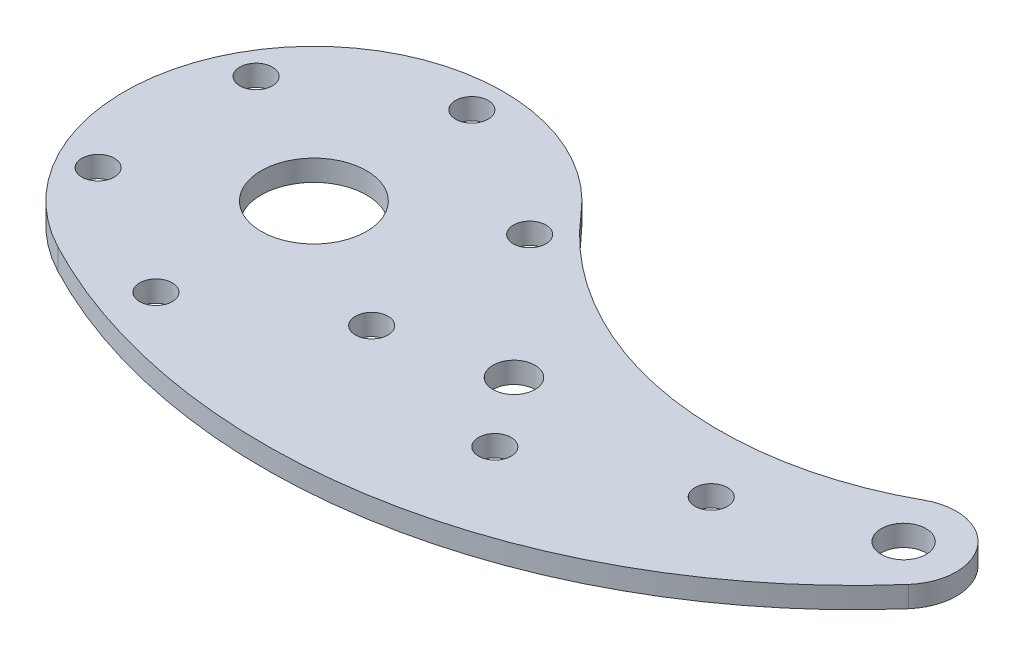
ISO-10303-21;
HEADER;
FILE_DESCRIPTION(('STEP AP214'),'2;1');
FILE_NAME('part.step','',(''),(''),'','','');
FILE_SCHEMA(('AUTOMOTIVE_DESIGN { 1 0 10303 214 1 1 1 1 }'));
ENDSEC;
DATA;
#1=APPLICATION_CONTEXT('core data for automotive mechanical design processes');
#2=APPLICATION_PROTOCOL_DEFINITION('international standard','automotive_design',2000,#1);
#3=PRODUCT_CONTEXT('',#1,'mechanical');
#4=PRODUCT('Part','Part','',(#3));
#5=PRODUCT_RELATED_PRODUCT_CATEGORY('part','',(#4));
#6=PRODUCT_DEFINITION_FORMATION('','',#4);
#7=PRODUCT_DEFINITION_CONTEXT('part definition',#1,'design');
#8=PRODUCT_DEFINITION('design','',#6,#7);
#9=PRODUCT_DEFINITION_SHAPE('','',#8);
#10=(LENGTH_UNIT() NAMED_UNIT(*) SI_UNIT(.MILLI.,.METRE.));
#11=(NAMED_UNIT(*) PLANE_ANGLE_UNIT() SI_UNIT($,.RADIAN.));
#12=(NAMED_UNIT(*) SI_UNIT($,.STERADIAN.) SOLID_ANGLE_UNIT());
#13=UNCERTAINTY_MEASURE_WITH_UNIT(LENGTH_MEASURE(1.E-05),#10,'distance_accuracy_value','');
#14=(GEOMETRIC_REPRESENTATION_CONTEXT(3) GLOBAL_UNCERTAINTY_ASSIGNED_CONTEXT((#13)) GLOBAL_UNIT_ASSIGNED_CONTEXT((#10,
#11,#12)) REPRESENTATION_CONTEXT('',''));
#15=CARTESIAN_POINT('',(0.,0.,0.));
#16=DIRECTION('',(0.,0.,1.));
#17=DIRECTION('',(1.,0.,0.));
#18=AXIS2_PLACEMENT_3D('',#15,#16,#17);
#19=CARTESIAN_POINT('',(0.,3.175,0.));
#20=DIRECTION('',(0.,-1.,0.));
#21=DIRECTION('',(0.,0.,-1.));
#22=AXIS2_PLACEMENT_3D('',#19,#20,#21);
#23=CYLINDRICAL_SURFACE('',#22,28.575);
#24=CARTESIAN_POINT('',(0.,0.,0.));
#25=DIRECTION('',(0.,1.,0.));
#26=DIRECTION('',(0.,0.,1.));
#27=AXIS2_PLACEMENT_3D('',#24,#25,#26);
#28=CIRCLE('',#27,28.575);
#29=CARTESIAN_POINT('',(21.7731294642857,0.,-18.5057142075483));
#30=VERTEX_POINT('',#29);
#31=CARTESIAN_POINT('',(-13.2871064379699,0.,25.2978937365556));
#32=VERTEX_POINT('',#31);
#33=EDGE_CURVE('E122',#30,#32,#28,.T.);
#34=ORIENTED_EDGE('',*,*,#33,.T.);
#35=DIRECTION('',(0.,-1.,0.));
#36=VECTOR('',#35,1.);
#37=CARTESIAN_POINT('',(-13.2871064379699,3.175,25.2978937365556));
#38=LINE('',#37,#36);
#39=CARTESIAN_POINT('',(-13.2871064379699,3.175,25.2978937365556));
#40=VERTEX_POINT('',#39);
#41=EDGE_CURVE('E11',#40,#32,#38,.T.);
#42=ORIENTED_EDGE('',*,*,#41,.F.);
#43=CARTESIAN_POINT('',(0.,3.175,0.));
#44=DIRECTION('',(0.,1.,0.));
#45=DIRECTION('',(0.,0.,1.));
#46=AXIS2_PLACEMENT_3D('',#43,#44,#45);
#47=CIRCLE('',#46,28.575);
#48=CARTESIAN_POINT('',(21.7731294642857,3.175,-18.5057142075483));
#49=VERTEX_POINT('',#48);
#50=EDGE_CURVE('E100',#49,#40,#47,.T.);
#51=ORIENTED_EDGE('',*,*,#50,.F.);
#52=DIRECTION('',(0.,-1.,0.));
#53=VECTOR('',#52,1.);
#54=CARTESIAN_POINT('',(21.7731294642857,3.175,-18.5057142075483));
#55=LINE('',#54,#53);
#56=EDGE_CURVE('E67',#49,#30,#55,.T.);
#57=ORIENTED_EDGE('',*,*,#56,.T.);
#58=EDGE_LOOP('',(#34,#42,#51,#57));
#59=FACE_BOUND('',#58,.T.);
#60=ADVANCED_FACE('F49',(#59),#23,.T.);
#61=CARTESIAN_POINT('',(28.0505580357143,3.175,-53.4066645549507));
#62=DIRECTION('',(0.,-1.,0.));
#63=DIRECTION('',(0.,0.,-1.));
#64=AXIS2_PLACEMENT_3D('',#61,#62,#63);
#65=CYLINDRICAL_SURFACE('',#64,88.9);
#66=CARTESIAN_POINT('',(28.0505580357143,0.,-53.4066645549507));
#67=DIRECTION('',(0.,1.,0.));
#68=DIRECTION('',(0.,0.,1.));
#69=AXIS2_PLACEMENT_3D('',#66,#67,#68);
#70=CIRCLE('',#69,88.9);
#71=CARTESIAN_POINT('',(94.8656315651261,0.,5.23594750538732));
#72=VERTEX_POINT('',#71);
#73=EDGE_CURVE('E105',#32,#72,#70,.T.);
#74=ORIENTED_EDGE('',*,*,#73,.T.);
#75=DIRECTION('',(0.,-1.,0.));
#76=VECTOR('',#75,1.);
#77=CARTESIAN_POINT('',(94.8656315651261,3.175,5.23594750538732));
#78=LINE('',#77,#76);
#79=CARTESIAN_POINT('',(94.8656315651261,3.175,5.23594750538732));
#80=VERTEX_POINT('',#79);
#81=EDGE_CURVE('E59',#80,#72,#78,.T.);
#82=ORIENTED_EDGE('',*,*,#81,.F.);
#83=CARTESIAN_POINT('',(28.0505580357143,3.175,-53.4066645549507));
#84=DIRECTION('',(0.,1.,0.));
#85=DIRECTION('',(0.,0.,1.));
#86=AXIS2_PLACEMENT_3D('',#83,#84,#85);
#87=CIRCLE('',#86,88.9);
#88=EDGE_CURVE('E93',#40,#80,#87,.T.);
#89=ORIENTED_EDGE('',*,*,#88,.F.);
#90=ORIENTED_EDGE('',*,*,#41,.T.);
#91=EDGE_LOOP('',(#74,#82,#89,#90));
#92=FACE_BOUND('',#91,.T.);
#93=ADVANCED_FACE('F104',(#92),#65,.T.);
#94=CARTESIAN_POINT('',(88.9,3.175,0.));
#95=DIRECTION('',(0.,-1.,0.));
#96=DIRECTION('',(0.,0.,-1.));
#97=AXIS2_PLACEMENT_3D('',#94,#95,#96);
#98=CYLINDRICAL_SURFACE('',#97,7.9375);
#99=CARTESIAN_POINT('',(88.9,0.,0.));
#100=DIRECTION('',(0.,1.,0.));
#101=DIRECTION('',(0.,0.,1.));
#102=AXIS2_PLACEMENT_3D('',#99,#100,#101);
#103=CIRCLE('',#102,7.9375);
#104=CARTESIAN_POINT('',(85.0595831322394,0.,-6.94658941724785));
#105=VERTEX_POINT('',#104);
#106=EDGE_CURVE('E125',#72,#105,#103,.T.);
#107=ORIENTED_EDGE('',*,*,#106,.T.);
#108=DIRECTION('',(0.,-1.,0.));
#109=VECTOR('',#108,1.);
#110=CARTESIAN_POINT('',(85.0595831322394,3.175,-6.94658941724785));
#111=LINE('',#110,#109);
#112=CARTESIAN_POINT('',(85.0595831322394,3.175,-6.94658941724785));
#113=VERTEX_POINT('',#112);
#114=EDGE_CURVE('E82',#113,#105,#111,.T.);
#115=ORIENTED_EDGE('',*,*,#114,.F.);
#116=CARTESIAN_POINT('',(88.9,3.175,0.));
#117=DIRECTION('',(0.,1.,0.));
#118=DIRECTION('',(0.,0.,1.));
#119=AXIS2_PLACEMENT_3D('',#116,#117,#118);
#120=CIRCLE('',#119,7.9375);
#121=EDGE_CURVE('E99',#80,#113,#120,.T.);
#122=ORIENTED_EDGE('',*,*,#121,.F.);
#123=ORIENTED_EDGE('',*,*,#81,.T.);
#124=EDGE_LOOP('',(#107,#115,#122,#123));
#125=FACE_BOUND('',#124,.T.);
#126=ADVANCED_FACE('F109',(#125),#98,.T.);
#127=CARTESIAN_POINT('',(88.9,3.175,0.));
#128=DIRECTION('',(0.,-1.,0.));
#129=DIRECTION('',(0.,0.,-1.));
#130=AXIS2_PLACEMENT_3D('',#127,#128,#129);
#131=CYLINDRICAL_SURFACE('',#130,3.37819999999999);
#132=CARTESIAN_POINT('',(88.9,3.175,0.));
#133=DIRECTION('',(0.,1.,0.));
#134=DIRECTION('',(0.,0.,1.));
#135=AXIS2_PLACEMENT_3D('',#132,#133,#134);
#136=CIRCLE('',#135,3.37819999999999);
#137=CARTESIAN_POINT('',(88.9,3.175,3.37819999999999));
#138=VERTEX_POINT('',#137);
#139=EDGE_CURVE('E134',#138,#138,#136,.T.);
#140=ORIENTED_EDGE('',*,*,#139,.T.);
#141=EDGE_LOOP('',(#140));
#142=FACE_BOUND('',#141,.T.);
#143=CARTESIAN_POINT('',(88.9,0.,0.));
#144=DIRECTION('',(0.,1.,0.));
#145=DIRECTION('',(0.,0.,1.));
#146=AXIS2_PLACEMENT_3D('',#143,#144,#145);
#147=CIRCLE('',#146,3.37819999999999);
#148=CARTESIAN_POINT('',(88.9,0.,3.37819999999999));
#149=VERTEX_POINT('',#148);
#150=EDGE_CURVE('E118',#149,#149,#147,.T.);
#151=ORIENTED_EDGE('',*,*,#150,.F.);
#152=EDGE_LOOP('',(#151));
#153=FACE_BOUND('',#152,.T.);
#154=ADVANCED_FACE('F219',(#142,#153),#131,.F.);
#155=CARTESIAN_POINT('',(0.,3.175,0.));
#156=DIRECTION('',(0.,-1.,0.));
#157=DIRECTION('',(0.,0.,-1.));
#158=AXIS2_PLACEMENT_3D('',#155,#156,#157);
#159=CYLINDRICAL_SURFACE('',#158,7.9375);
#160=CARTESIAN_POINT('',(0.,3.175,0.));
#161=DIRECTION('',(0.,1.,0.));
#162=DIRECTION('',(0.,0.,1.));
#163=AXIS2_PLACEMENT_3D('',#160,#161,#162);
#164=CIRCLE('',#163,7.9375);
#165=CARTESIAN_POINT('',(0.,3.175,7.9375));
#166=VERTEX_POINT('',#165);
#167=EDGE_CURVE('E130',#166,#166,#164,.T.);
#168=ORIENTED_EDGE('',*,*,#167,.T.);
#169=EDGE_LOOP('',(#168));
#170=FACE_BOUND('',#169,.T.);
#171=CARTESIAN_POINT('',(0.,0.,0.));
#172=DIRECTION('',(0.,1.,0.));
#173=DIRECTION('',(0.,0.,1.));
#174=AXIS2_PLACEMENT_3D('',#171,#172,#173);
#175=CIRCLE('',#174,7.9375);
#176=CARTESIAN_POINT('',(0.,0.,7.9375));
#177=VERTEX_POINT('',#176);
#178=EDGE_CURVE('E115',#177,#177,#175,.T.);
#179=ORIENTED_EDGE('',*,*,#178,.F.);
#180=EDGE_LOOP('',(#179));
#181=FACE_BOUND('',#180,.T.);
#182=ADVANCED_FACE('F51',(#170,#181),#159,.F.);
#183=CARTESIAN_POINT('',(60.4809151785714,3.175,-51.404761687634));
#184=DIRECTION('',(0.,-1.,0.));
#185=DIRECTION('',(0.,0.,-1.));
#186=AXIS2_PLACEMENT_3D('',#183,#184,#185);
#187=CYLINDRICAL_SURFACE('',#186,50.8);
#188=CARTESIAN_POINT('',(60.4809151785714,0.,-51.404761687634));
#189=DIRECTION('',(0.,1.,0.));
#190=DIRECTION('',(0.,0.,1.));
#191=AXIS2_PLACEMENT_3D('',#188,#189,#190);
#192=CIRCLE('',#191,50.8);
#193=EDGE_CURVE('E127',#30,#105,#192,.T.);
#194=ORIENTED_EDGE('',*,*,#193,.F.);
#195=ORIENTED_EDGE('',*,*,#56,.F.);
#196=CARTESIAN_POINT('',(60.4809151785714,3.175,-51.404761687634));
#197=DIRECTION('',(0.,1.,0.));
#198=DIRECTION('',(0.,0.,1.));
#199=AXIS2_PLACEMENT_3D('',#196,#197,#198);
#200=CIRCLE('',#199,50.8);
#201=EDGE_CURVE('E110',#49,#113,#200,.T.);
#202=ORIENTED_EDGE('',*,*,#201,.T.);
#203=ORIENTED_EDGE('',*,*,#114,.T.);
#204=EDGE_LOOP('',(#194,#195,#202,#203));
#205=FACE_BOUND('',#204,.T.);
#206=ADVANCED_FACE('F198',(#205),#187,.F.);
#207=CARTESIAN_POINT('',(0.,3.175,0.));
#208=DIRECTION('',(0.,1.,0.));
#209=DIRECTION('',(0.,0.,1.));
#210=AXIS2_PLACEMENT_3D('',#207,#208,#209);
#211=PLANE('',#210);
#212=CARTESIAN_POINT('',(68.58,3.175,8.68011214699575));
#213=DIRECTION('',(0.,1.,0.));
#214=DIRECTION('',(0.,0.,1.));
#215=AXIS2_PLACEMENT_3D('',#212,#213,#214);
#216=CIRCLE('',#215,2.45745);
#217=CARTESIAN_POINT('',(68.58,3.175,11.1375621469957));
#218=VERTEX_POINT('',#217);
#219=EDGE_CURVE('E188',#218,#218,#216,.T.);
#220=ORIENTED_EDGE('',*,*,#219,.F.);
#221=EDGE_LOOP('',(#220));
#222=FACE_BOUND('',#221,.T.);
#223=CARTESIAN_POINT('',(45.72,3.175,18.445238312366));
#224=DIRECTION('',(0.,1.,0.));
#225=DIRECTION('',(0.,0.,1.));
#226=AXIS2_PLACEMENT_3D('',#223,#224,#225);
#227=CIRCLE('',#226,2.45745);
#228=CARTESIAN_POINT('',(45.72,3.175,20.902688312366));
#229=VERTEX_POINT('',#228);
#230=EDGE_CURVE('E182',#229,#229,#227,.T.);
#231=ORIENTED_EDGE('',*,*,#230,.F.);
#232=EDGE_LOOP('',(#231));
#233=FACE_BOUND('',#232,.T.);
#234=CARTESIAN_POINT('',(38.1,3.175,7.9375));
#235=DIRECTION('',(0.,1.,0.));
#236=DIRECTION('',(0.,0.,1.));
#237=AXIS2_PLACEMENT_3D('',#234,#235,#236);
#238=CIRCLE('',#237,3.17499999999998);
#239=CARTESIAN_POINT('',(38.1,3.175,11.1125));
#240=VERTEX_POINT('',#239);
#241=EDGE_CURVE('E179',#240,#240,#238,.T.);
#242=ORIENTED_EDGE('',*,*,#241,.F.);
#243=EDGE_LOOP('',(#242));
#244=FACE_BOUND('',#243,.T.);
#245=CARTESIAN_POINT('',(-20.6222299276169,3.175,-11.90625));
#246=DIRECTION('',(0.,1.,0.));
#247=DIRECTION('',(0.,0.,1.));
#248=AXIS2_PLACEMENT_3D('',#245,#246,#247);
#249=CIRCLE('',#248,2.45745);
#250=CARTESIAN_POINT('',(-20.6222299276169,3.175,-9.4488));
#251=VERTEX_POINT('',#250);
#252=EDGE_CURVE('E173',#251,#251,#249,.T.);
#253=ORIENTED_EDGE('',*,*,#252,.F.);
#254=EDGE_LOOP('',(#253));
#255=FACE_BOUND('',#254,.T.);
#256=CARTESIAN_POINT('',(20.6222299276169,3.175,-11.90625));
#257=DIRECTION('',(0.,1.,0.));
#258=DIRECTION('',(0.,0.,1.));
#259=AXIS2_PLACEMENT_3D('',#256,#257,#258);
#260=CIRCLE('',#259,2.45745);
#261=CARTESIAN_POINT('',(20.6222299276169,3.175,-9.4488));
#262=VERTEX_POINT('',#261);
#263=EDGE_CURVE('E167',#262,#262,#260,.T.);
#264=ORIENTED_EDGE('',*,*,#263,.F.);
#265=EDGE_LOOP('',(#264));
#266=FACE_BOUND('',#265,.T.);
#267=CARTESIAN_POINT('',(20.6222299276169,3.175,11.90625));
#268=DIRECTION('',(0.,1.,0.));
#269=DIRECTION('',(0.,0.,1.));
#270=AXIS2_PLACEMENT_3D('',#267,#268,#269);
#271=CIRCLE('',#270,2.45745);
#272=CARTESIAN_POINT('',(20.6222299276169,3.175,14.3637));
#273=VERTEX_POINT('',#272);
#274=EDGE_CURVE('E161',#273,#273,#271,.T.);
#275=ORIENTED_EDGE('',*,*,#274,.F.);
#276=EDGE_LOOP('',(#275));
#277=FACE_BOUND('',#276,.T.);
#278=CARTESIAN_POINT('',(-20.6222299276169,3.175,11.90625));
#279=DIRECTION('',(0.,1.,0.));
#280=DIRECTION('',(0.,0.,1.));
#281=AXIS2_PLACEMENT_3D('',#278,#279,#280);
#282=CIRCLE('',#281,2.45745);
#283=CARTESIAN_POINT('',(-20.6222299276169,3.175,14.3637));
#284=VERTEX_POINT('',#283);
#285=EDGE_CURVE('E155',#284,#284,#282,.T.);
#286=ORIENTED_EDGE('',*,*,#285,.F.);
#287=EDGE_LOOP('',(#286));
#288=FACE_BOUND('',#287,.T.);
#289=CARTESIAN_POINT('',(0.,3.175,-23.8125));
#290=DIRECTION('',(0.,1.,0.));
#291=DIRECTION('',(0.,0.,1.));
#292=AXIS2_PLACEMENT_3D('',#289,#290,#291);
#293=CIRCLE('',#292,2.45745);
#294=CARTESIAN_POINT('',(0.,3.175,-21.35505));
#295=VERTEX_POINT('',#294);
#296=EDGE_CURVE('E149',#295,#295,#293,.T.);
#297=ORIENTED_EDGE('',*,*,#296,.F.);
#298=EDGE_LOOP('',(#297));
#299=FACE_BOUND('',#298,.T.);
#300=CARTESIAN_POINT('',(0.,3.175,23.8125));
#301=DIRECTION('',(0.,1.,0.));
#302=DIRECTION('',(0.,0.,1.));
#303=AXIS2_PLACEMENT_3D('',#300,#301,#302);
#304=CIRCLE('',#303,2.45745);
#305=CARTESIAN_POINT('',(0.,3.175,26.26995));
#306=VERTEX_POINT('',#305);
#307=EDGE_CURVE('E143',#306,#306,#304,.T.);
#308=ORIENTED_EDGE('',*,*,#307,.F.);
#309=EDGE_LOOP('',(#308));
#310=FACE_BOUND('',#309,.T.);
#311=ORIENTED_EDGE('',*,*,#167,.F.);
#312=EDGE_LOOP('',(#311));
#313=FACE_BOUND('',#312,.T.);
#314=ORIENTED_EDGE('',*,*,#139,.F.);
#315=EDGE_LOOP('',(#314));
#316=FACE_BOUND('',#315,.T.);
#317=ORIENTED_EDGE('',*,*,#50,.T.);
#318=ORIENTED_EDGE('',*,*,#88,.T.);
#319=ORIENTED_EDGE('',*,*,#121,.T.);
#320=ORIENTED_EDGE('',*,*,#201,.F.);
#321=EDGE_LOOP('',(#317,#318,#319,#320));
#322=FACE_BOUND('',#321,.T.);
#323=ADVANCED_FACE('F96',(#222,#233,#244,#255,#266,#277,#288,#299,#310,#313,#316,#322),#211,.T.);
#324=CARTESIAN_POINT('',(0.,0.,0.));
#325=DIRECTION('',(0.,1.,0.));
#326=DIRECTION('',(0.,0.,1.));
#327=AXIS2_PLACEMENT_3D('',#324,#325,#326);
#328=PLANE('',#327);
#329=CARTESIAN_POINT('',(68.58,0.,8.68011214699575));
#330=DIRECTION('',(0.,1.,0.));
#331=DIRECTION('',(0.,0.,1.));
#332=AXIS2_PLACEMENT_3D('',#329,#330,#331);
#333=CIRCLE('',#332,2.45745);
#334=CARTESIAN_POINT('',(68.58,0.,11.1375621469957));
#335=VERTEX_POINT('',#334);
#336=EDGE_CURVE('E185',#335,#335,#333,.T.);
#337=ORIENTED_EDGE('',*,*,#336,.T.);
#338=EDGE_LOOP('',(#337));
#339=FACE_BOUND('',#338,.T.);
#340=CARTESIAN_POINT('',(45.72,0.,18.445238312366));
#341=DIRECTION('',(0.,1.,0.));
#342=DIRECTION('',(0.,0.,1.));
#343=AXIS2_PLACEMENT_3D('',#340,#341,#342);
#344=CIRCLE('',#343,2.45745);
#345=CARTESIAN_POINT('',(45.72,0.,20.902688312366));
#346=VERTEX_POINT('',#345);
#347=EDGE_CURVE('E53',#346,#346,#344,.T.);
#348=ORIENTED_EDGE('',*,*,#347,.T.);
#349=EDGE_LOOP('',(#348));
#350=FACE_BOUND('',#349,.T.);
#351=CARTESIAN_POINT('',(38.1,0.,7.9375));
#352=DIRECTION('',(0.,1.,0.));
#353=DIRECTION('',(0.,0.,1.));
#354=AXIS2_PLACEMENT_3D('',#351,#352,#353);
#355=CIRCLE('',#354,3.17499999999999);
#356=CARTESIAN_POINT('',(38.1,0.,11.1125));
#357=VERTEX_POINT('',#356);
#358=EDGE_CURVE('E176',#357,#357,#355,.T.);
#359=ORIENTED_EDGE('',*,*,#358,.T.);
#360=EDGE_LOOP('',(#359));
#361=FACE_BOUND('',#360,.T.);
#362=CARTESIAN_POINT('',(-20.6222299276169,0.,-11.90625));
#363=DIRECTION('',(0.,1.,0.));
#364=DIRECTION('',(0.,0.,1.));
#365=AXIS2_PLACEMENT_3D('',#362,#363,#364);
#366=CIRCLE('',#365,2.45744999999999);
#367=CARTESIAN_POINT('',(-20.6222299276169,0.,-9.44880000000001));
#368=VERTEX_POINT('',#367);
#369=EDGE_CURVE('E170',#368,#368,#366,.T.);
#370=ORIENTED_EDGE('',*,*,#369,.T.);
#371=EDGE_LOOP('',(#370));
#372=FACE_BOUND('',#371,.T.);
#373=CARTESIAN_POINT('',(20.6222299276169,0.,-11.90625));
#374=DIRECTION('',(0.,1.,0.));
#375=DIRECTION('',(0.,0.,1.));
#376=AXIS2_PLACEMENT_3D('',#373,#374,#375);
#377=CIRCLE('',#376,2.45744999999999);
#378=CARTESIAN_POINT('',(20.6222299276169,0.,-9.44880000000001));
#379=VERTEX_POINT('',#378);
#380=EDGE_CURVE('E164',#379,#379,#377,.T.);
#381=ORIENTED_EDGE('',*,*,#380,.T.);
#382=EDGE_LOOP('',(#381));
#383=FACE_BOUND('',#382,.T.);
#384=CARTESIAN_POINT('',(20.6222299276169,0.,11.90625));
#385=DIRECTION('',(0.,1.,0.));
#386=DIRECTION('',(0.,0.,1.));
#387=AXIS2_PLACEMENT_3D('',#384,#385,#386);
#388=CIRCLE('',#387,2.45744999999999);
#389=CARTESIAN_POINT('',(20.6222299276169,0.,14.3637));
#390=VERTEX_POINT('',#389);
#391=EDGE_CURVE('E158',#390,#390,#388,.T.);
#392=ORIENTED_EDGE('',*,*,#391,.T.);
#393=EDGE_LOOP('',(#392));
#394=FACE_BOUND('',#393,.T.);
#395=CARTESIAN_POINT('',(-20.6222299276169,0.,11.90625));
#396=DIRECTION('',(0.,1.,0.));
#397=DIRECTION('',(0.,0.,1.));
#398=AXIS2_PLACEMENT_3D('',#395,#396,#397);
#399=CIRCLE('',#398,2.45744999999999);
#400=CARTESIAN_POINT('',(-20.6222299276169,0.,14.3637));
#401=VERTEX_POINT('',#400);
#402=EDGE_CURVE('E152',#401,#401,#399,.T.);
#403=ORIENTED_EDGE('',*,*,#402,.T.);
#404=EDGE_LOOP('',(#403));
#405=FACE_BOUND('',#404,.T.);
#406=CARTESIAN_POINT('',(0.,0.,-23.8125));
#407=DIRECTION('',(0.,1.,0.));
#408=DIRECTION('',(0.,0.,1.));
#409=AXIS2_PLACEMENT_3D('',#406,#407,#408);
#410=CIRCLE('',#409,2.45744999999999);
#411=CARTESIAN_POINT('',(0.,0.,-21.35505));
#412=VERTEX_POINT('',#411);
#413=EDGE_CURVE('E146',#412,#412,#410,.T.);
#414=ORIENTED_EDGE('',*,*,#413,.T.);
#415=EDGE_LOOP('',(#414));
#416=FACE_BOUND('',#415,.T.);
#417=CARTESIAN_POINT('',(0.,0.,23.8125));
#418=DIRECTION('',(0.,1.,0.));
#419=DIRECTION('',(0.,0.,1.));
#420=AXIS2_PLACEMENT_3D('',#417,#418,#419);
#421=CIRCLE('',#420,2.45744999999999);
#422=CARTESIAN_POINT('',(0.,0.,26.26995));
#423=VERTEX_POINT('',#422);
#424=EDGE_CURVE('E119',#423,#423,#421,.T.);
#425=ORIENTED_EDGE('',*,*,#424,.T.);
#426=EDGE_LOOP('',(#425));
#427=FACE_BOUND('',#426,.T.);
#428=ORIENTED_EDGE('',*,*,#178,.T.);
#429=EDGE_LOOP('',(#428));
#430=FACE_BOUND('',#429,.T.);
#431=ORIENTED_EDGE('',*,*,#150,.T.);
#432=EDGE_LOOP('',(#431));
#433=FACE_BOUND('',#432,.T.);
#434=ORIENTED_EDGE('',*,*,#33,.F.);
#435=ORIENTED_EDGE('',*,*,#193,.T.);
#436=ORIENTED_EDGE('',*,*,#106,.F.);
#437=ORIENTED_EDGE('',*,*,#73,.F.);
#438=EDGE_LOOP('',(#434,#435,#436,#437));
#439=FACE_BOUND('',#438,.T.);
#440=ADVANCED_FACE('F197',(#339,#350,#361,#372,#383,#394,#405,#416,#427,#430,#433,#439),#328,.F.);
#441=CARTESIAN_POINT('',(0.,3.175,23.8125));
#442=DIRECTION('',(0.,1.,0.));
#443=DIRECTION('',(0.,0.,1.));
#444=AXIS2_PLACEMENT_3D('',#441,#442,#443);
#445=CYLINDRICAL_SURFACE('',#444,2.45744999999999);
#446=ORIENTED_EDGE('',*,*,#424,.F.);
#447=EDGE_LOOP('',(#446));
#448=FACE_BOUND('',#447,.T.);
#449=ORIENTED_EDGE('',*,*,#307,.T.);
#450=EDGE_LOOP('',(#449));
#451=FACE_BOUND('',#450,.T.);
#452=ADVANCED_FACE('F225',(#448,#451),#445,.F.);
#453=CARTESIAN_POINT('',(0.,3.175,-23.8125));
#454=DIRECTION('',(0.,1.,0.));
#455=DIRECTION('',(0.,0.,1.));
#456=AXIS2_PLACEMENT_3D('',#453,#454,#455);
#457=CYLINDRICAL_SURFACE('',#456,2.45744999999999);
#458=ORIENTED_EDGE('',*,*,#413,.F.);
#459=EDGE_LOOP('',(#458));
#460=FACE_BOUND('',#459,.T.);
#461=ORIENTED_EDGE('',*,*,#296,.T.);
#462=EDGE_LOOP('',(#461));
#463=FACE_BOUND('',#462,.T.);
#464=ADVANCED_FACE('F289',(#460,#463),#457,.F.);
#465=CARTESIAN_POINT('',(-20.6222299276169,3.175,11.90625));
#466=DIRECTION('',(0.,1.,0.));
#467=DIRECTION('',(0.,0.,1.));
#468=AXIS2_PLACEMENT_3D('',#465,#466,#467);
#469=CYLINDRICAL_SURFACE('',#468,2.45744999999999);
#470=ORIENTED_EDGE('',*,*,#402,.F.);
#471=EDGE_LOOP('',(#470));
#472=FACE_BOUND('',#471,.T.);
#473=ORIENTED_EDGE('',*,*,#285,.T.);
#474=EDGE_LOOP('',(#473));
#475=FACE_BOUND('',#474,.T.);
#476=ADVANCED_FACE('F299',(#472,#475),#469,.F.);
#477=CARTESIAN_POINT('',(20.6222299276169,3.175,11.90625));
#478=DIRECTION('',(0.,1.,0.));
#479=DIRECTION('',(0.,0.,1.));
#480=AXIS2_PLACEMENT_3D('',#477,#478,#479);
#481=CYLINDRICAL_SURFACE('',#480,2.45744999999999);
#482=ORIENTED_EDGE('',*,*,#391,.F.);
#483=EDGE_LOOP('',(#482));
#484=FACE_BOUND('',#483,.T.);
#485=ORIENTED_EDGE('',*,*,#274,.T.);
#486=EDGE_LOOP('',(#485));
#487=FACE_BOUND('',#486,.T.);
#488=ADVANCED_FACE('F309',(#484,#487),#481,.F.);
#489=CARTESIAN_POINT('',(20.6222299276169,3.175,-11.90625));
#490=DIRECTION('',(0.,1.,0.));
#491=DIRECTION('',(0.,0.,1.));
#492=AXIS2_PLACEMENT_3D('',#489,#490,#491);
#493=CYLINDRICAL_SURFACE('',#492,2.45744999999999);
#494=ORIENTED_EDGE('',*,*,#380,.F.);
#495=EDGE_LOOP('',(#494));
#496=FACE_BOUND('',#495,.T.);
#497=ORIENTED_EDGE('',*,*,#263,.T.);
#498=EDGE_LOOP('',(#497));
#499=FACE_BOUND('',#498,.T.);
#500=ADVANCED_FACE('F319',(#496,#499),#493,.F.);
#501=CARTESIAN_POINT('',(-20.6222299276169,3.175,-11.90625));
#502=DIRECTION('',(0.,1.,0.));
#503=DIRECTION('',(0.,0.,1.));
#504=AXIS2_PLACEMENT_3D('',#501,#502,#503);
#505=CYLINDRICAL_SURFACE('',#504,2.45744999999999);
#506=ORIENTED_EDGE('',*,*,#369,.F.);
#507=EDGE_LOOP('',(#506));
#508=FACE_BOUND('',#507,.T.);
#509=ORIENTED_EDGE('',*,*,#252,.T.);
#510=EDGE_LOOP('',(#509));
#511=FACE_BOUND('',#510,.T.);
#512=ADVANCED_FACE('F329',(#508,#511),#505,.F.);
#513=CARTESIAN_POINT('',(38.1,3.175,7.9375));
#514=DIRECTION('',(0.,1.,0.));
#515=DIRECTION('',(0.,0.,1.));
#516=AXIS2_PLACEMENT_3D('',#513,#514,#515);
#517=CYLINDRICAL_SURFACE('',#516,3.17499999999999);
#518=ORIENTED_EDGE('',*,*,#358,.F.);
#519=EDGE_LOOP('',(#518));
#520=FACE_BOUND('',#519,.T.);
#521=ORIENTED_EDGE('',*,*,#241,.T.);
#522=EDGE_LOOP('',(#521));
#523=FACE_BOUND('',#522,.T.);
#524=ADVANCED_FACE('F339',(#520,#523),#517,.F.);
#525=CARTESIAN_POINT('',(45.72,3.175,18.445238312366));
#526=DIRECTION('',(0.,1.,0.));
#527=DIRECTION('',(0.,0.,1.));
#528=AXIS2_PLACEMENT_3D('',#525,#526,#527);
#529=CYLINDRICAL_SURFACE('',#528,2.45745);
#530=ORIENTED_EDGE('',*,*,#230,.T.);
#531=EDGE_LOOP('',(#530));
#532=FACE_BOUND('',#531,.T.);
#533=ORIENTED_EDGE('',*,*,#347,.F.);
#534=EDGE_LOOP('',(#533));
#535=FACE_BOUND('',#534,.T.);
#536=ADVANCED_FACE('F348',(#532,#535),#529,.F.);
#537=CARTESIAN_POINT('',(68.58,3.175,8.68011214699575));
#538=DIRECTION('',(0.,1.,0.));
#539=DIRECTION('',(0.,0.,1.));
#540=AXIS2_PLACEMENT_3D('',#537,#538,#539);
#541=CYLINDRICAL_SURFACE('',#540,2.45745);
#542=ORIENTED_EDGE('',*,*,#219,.T.);
#543=EDGE_LOOP('',(#542));
#544=FACE_BOUND('',#543,.T.);
#545=ORIENTED_EDGE('',*,*,#336,.F.);
#546=EDGE_LOOP('',(#545));
#547=FACE_BOUND('',#546,.T.);
#548=ADVANCED_FACE('F192',(#544,#547),#541,.F.);
#549=CLOSED_SHELL('',(#60,#93,#126,#154,#182,#206,#323,#440,#452,#464,#476,#488,#500,#512,#524,
#536,#548));
#550=MANIFOLD_SOLID_BREP('B2',#549);
#551=ADVANCED_BREP_SHAPE_REPRESENTATION('',(#18,#550),#14);
#552=SHAPE_DEFINITION_REPRESENTATION(#9,#551);
ENDSEC;
END-ISO-10303-21;
